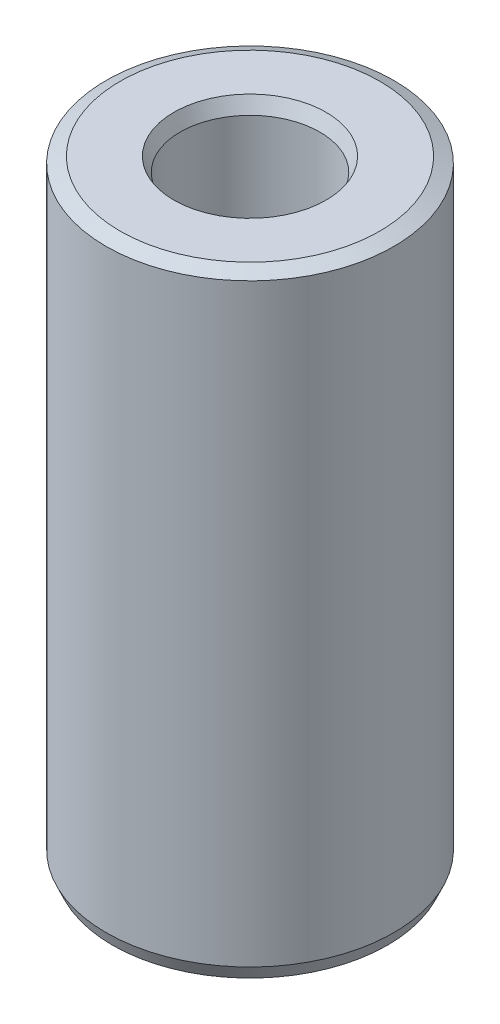
ISO-10303-21;
HEADER;
FILE_DESCRIPTION(('STEP AP214'),'2;1');
FILE_NAME('part.step','',(''),(''),'','','');
FILE_SCHEMA(('AUTOMOTIVE_DESIGN { 1 0 10303 214 1 1 1 1 }'));
ENDSEC;
DATA;
#1=APPLICATION_CONTEXT('core data for automotive mechanical design processes');
#2=APPLICATION_PROTOCOL_DEFINITION('international standard','automotive_design',2000,#1);
#3=PRODUCT_CONTEXT('',#1,'mechanical');
#4=PRODUCT('Part','Part','',(#3));
#5=PRODUCT_RELATED_PRODUCT_CATEGORY('part','',(#4));
#6=PRODUCT_DEFINITION_FORMATION('','',#4);
#7=PRODUCT_DEFINITION_CONTEXT('part definition',#1,'design');
#8=PRODUCT_DEFINITION('design','',#6,#7);
#9=PRODUCT_DEFINITION_SHAPE('','',#8);
#10=(LENGTH_UNIT() NAMED_UNIT(*) SI_UNIT(.MILLI.,.METRE.));
#11=(NAMED_UNIT(*) PLANE_ANGLE_UNIT() SI_UNIT($,.RADIAN.));
#12=(NAMED_UNIT(*) SI_UNIT($,.STERADIAN.) SOLID_ANGLE_UNIT());
#13=UNCERTAINTY_MEASURE_WITH_UNIT(LENGTH_MEASURE(1.E-05),#10,'distance_accuracy_value','');
#14=(GEOMETRIC_REPRESENTATION_CONTEXT(3) GLOBAL_UNCERTAINTY_ASSIGNED_CONTEXT((#13)) GLOBAL_UNIT_ASSIGNED_CONTEXT((#10,
#11,#12)) REPRESENTATION_CONTEXT('',''));
#15=CARTESIAN_POINT('',(0.,0.,0.));
#16=DIRECTION('',(0.,0.,1.));
#17=DIRECTION('',(1.,0.,0.));
#18=AXIS2_PLACEMENT_3D('',#15,#16,#17);
#19=CARTESIAN_POINT('',(0.,138.841651171034,0.));
#20=DIRECTION('',(0.,-1.,0.));
#21=DIRECTION('',(0.,0.,-1.));
#22=AXIS2_PLACEMENT_3D('',#19,#20,#21);
#23=CYLINDRICAL_SURFACE('',#22,32.5);
#24=CARTESIAN_POINT('',(0.,3.16370298457838,0.));
#25=DIRECTION('',(0.,1.,0.));
#26=DIRECTION('',(0.,0.,1.));
#27=AXIS2_PLACEMENT_3D('',#24,#25,#26);
#28=CIRCLE('',#27,32.5);
#29=CARTESIAN_POINT('',(0.,3.16370298457838,32.5));
#30=VERTEX_POINT('',#29);
#31=EDGE_CURVE('E10',#30,#30,#28,.T.);
#32=ORIENTED_EDGE('',*,*,#31,.T.);
#33=EDGE_LOOP('',(#32));
#34=FACE_BOUND('',#33,.T.);
#35=CARTESIAN_POINT('',(0.,137.426130079522,0.));
#36=DIRECTION('',(0.,1.,0.));
#37=DIRECTION('',(0.,0.,1.));
#38=AXIS2_PLACEMENT_3D('',#35,#36,#37);
#39=CIRCLE('',#38,32.5);
#40=CARTESIAN_POINT('',(0.,137.426130079522,32.5));
#41=VERTEX_POINT('',#40);
#42=EDGE_CURVE('E50',#41,#41,#39,.F.);
#43=ORIENTED_EDGE('',*,*,#42,.T.);
#44=EDGE_LOOP('',(#43));
#45=FACE_BOUND('',#44,.T.);
#46=ADVANCED_FACE('F39',(#34,#45),#23,.T.);
#47=CARTESIAN_POINT('',(0.,138.841651171034,0.));
#48=DIRECTION('',(0.,1.,0.));
#49=DIRECTION('',(0.,0.,1.));
#50=AXIS2_PLACEMENT_3D('',#47,#48,#49);
#51=PLANE('',#50);
#52=CARTESIAN_POINT('',(0.,138.841651171034,0.));
#53=DIRECTION('',(0.,1.,0.));
#54=DIRECTION('',(0.,0.,1.));
#55=AXIS2_PLACEMENT_3D('',#52,#53,#54);
#56=CIRCLE('',#55,17.201918085792);
#57=CARTESIAN_POINT('',(0.,138.841651171034,17.201918085792));
#58=VERTEX_POINT('',#57);
#59=EDGE_CURVE('E58',#58,#58,#56,.F.);
#60=ORIENTED_EDGE('',*,*,#59,.T.);
#61=EDGE_LOOP('',(#60));
#62=FACE_BOUND('',#61,.T.);
#63=CARTESIAN_POINT('',(0.,138.841651171034,0.));
#64=DIRECTION('',(0.,1.,0.));
#65=DIRECTION('',(0.,0.,1.));
#66=AXIS2_PLACEMENT_3D('',#63,#64,#65);
#67=CIRCLE('',#66,29.3362970154217);
#68=CARTESIAN_POINT('',(0.,138.841651171034,29.3362970154217));
#69=VERTEX_POINT('',#68);
#70=EDGE_CURVE('E61',#69,#69,#67,.T.);
#71=ORIENTED_EDGE('',*,*,#70,.T.);
#72=EDGE_LOOP('',(#71));
#73=FACE_BOUND('',#72,.T.);
#74=ADVANCED_FACE('F88',(#62,#73),#51,.T.);
#75=CARTESIAN_POINT('',(0.,0.,0.));
#76=DIRECTION('',(0.,1.,0.));
#77=DIRECTION('',(0.,0.,1.));
#78=AXIS2_PLACEMENT_3D('',#75,#76,#77);
#79=PLANE('',#78);
#80=CARTESIAN_POINT('',(0.,0.,0.));
#81=DIRECTION('',(0.,1.,0.));
#82=DIRECTION('',(0.,0.,1.));
#83=AXIS2_PLACEMENT_3D('',#80,#81,#82);
#84=CIRCLE('',#83,18.9500999788592);
#85=CARTESIAN_POINT('',(0.,0.,18.9500999788592));
#86=VERTEX_POINT('',#85);
#87=EDGE_CURVE('E51',#86,#86,#84,.T.);
#88=ORIENTED_EDGE('',*,*,#87,.T.);
#89=EDGE_LOOP('',(#88));
#90=FACE_BOUND('',#89,.T.);
#91=CARTESIAN_POINT('',(0.,0.,0.));
#92=DIRECTION('',(0.,1.,0.));
#93=DIRECTION('',(0.,0.,1.));
#94=AXIS2_PLACEMENT_3D('',#91,#92,#93);
#95=CIRCLE('',#94,31.0844789084888);
#96=CARTESIAN_POINT('',(0.,0.,31.0844789084888));
#97=VERTEX_POINT('',#96);
#98=EDGE_CURVE('E54',#97,#97,#95,.F.);
#99=ORIENTED_EDGE('',*,*,#98,.T.);
#100=EDGE_LOOP('',(#99));
#101=FACE_BOUND('',#100,.T.);
#102=ADVANCED_FACE('F83',(#90,#101),#79,.F.);
#103=CARTESIAN_POINT('',(0.,138.841651171034,0.));
#104=DIRECTION('',(0.,-1.,0.));
#105=DIRECTION('',(0.,0.,-1.));
#106=AXIS2_PLACEMENT_3D('',#103,#104,#105);
#107=CYLINDRICAL_SURFACE('',#106,15.7863969942809);
#108=CARTESIAN_POINT('',(0.,135.677948186455,0.));
#109=DIRECTION('',(0.,1.,0.));
#110=DIRECTION('',(0.,0.,1.));
#111=AXIS2_PLACEMENT_3D('',#108,#109,#110);
#112=CIRCLE('',#111,15.7863969942809);
#113=CARTESIAN_POINT('',(0.,135.677948186455,15.7863969942809));
#114=VERTEX_POINT('',#113);
#115=EDGE_CURVE('E67',#114,#114,#112,.T.);
#116=ORIENTED_EDGE('',*,*,#115,.T.);
#117=EDGE_LOOP('',(#116));
#118=FACE_BOUND('',#117,.T.);
#119=CARTESIAN_POINT('',(0.,1.41552109151116,0.));
#120=DIRECTION('',(0.,1.,0.));
#121=DIRECTION('',(0.,0.,1.));
#122=AXIS2_PLACEMENT_3D('',#119,#120,#121);
#123=CIRCLE('',#122,15.7863969942809);
#124=CARTESIAN_POINT('',(0.,1.41552109151116,15.7863969942809));
#125=VERTEX_POINT('',#124);
#126=EDGE_CURVE('E69',#125,#125,#123,.F.);
#127=ORIENTED_EDGE('',*,*,#126,.T.);
#128=EDGE_LOOP('',(#127));
#129=FACE_BOUND('',#128,.T.);
#130=ADVANCED_FACE('F71',(#118,#129),#107,.F.);
#131=CARTESIAN_POINT('',(0.,135.677948186455,0.));
#132=DIRECTION('',(0.,1.,0.));
#133=DIRECTION('',(0.,0.,1.));
#134=AXIS2_PLACEMENT_3D('',#131,#132,#133);
#135=CONICAL_SURFACE('',#134,15.7863969942809,0.42071082988232);
#136=CARTESIAN_POINT('',(0.,138.841651171034,17.201918085792));
#137=CARTESIAN_POINT('',(0.,138.808695931611,17.1871730744221));
#138=CARTESIAN_POINT('',(0.,138.775740692188,17.1724280630522));
#139=CARTESIAN_POINT('',(0.,138.709830213343,17.1429380403124));
#140=CARTESIAN_POINT('',(0.,138.67687497392,17.1281930289425));
#141=CARTESIAN_POINT('',(0.,138.610964495075,17.0987030062027));
#142=CARTESIAN_POINT('',(0.,138.578009255652,17.0839579948328));
#143=CARTESIAN_POINT('',(0.,138.512098776807,17.054467972093));
#144=CARTESIAN_POINT('',(0.,138.479143537384,17.0397229607231));
#145=CARTESIAN_POINT('',(0.,138.413233058539,17.0102329379832));
#146=CARTESIAN_POINT('',(0.,138.380277819116,16.9954879266133));
#147=CARTESIAN_POINT('',(0.,138.31436734027,16.9659979038735));
#148=CARTESIAN_POINT('',(0.,138.281412100848,16.9512528925036));
#149=CARTESIAN_POINT('',(0.,138.215501622002,16.9217628697638));
#150=CARTESIAN_POINT('',(0.,138.18254638258,16.9070178583939));
#151=CARTESIAN_POINT('',(0.,138.116635903734,16.8775278356541));
#152=CARTESIAN_POINT('',(0.,138.083680664312,16.8627828242842));
#153=CARTESIAN_POINT('',(0.,138.017770185466,16.8332928015443));
#154=CARTESIAN_POINT('',(0.,137.984814946044,16.8185477901744));
#155=CARTESIAN_POINT('',(0.,137.918904467198,16.7890577674346));
#156=CARTESIAN_POINT('',(0.,137.885949227776,16.7743127560647));
#157=CARTESIAN_POINT('',(0.,137.82003874893,16.7448227333249));
#158=CARTESIAN_POINT('',(0.,137.787083509507,16.730077721955));
#159=CARTESIAN_POINT('',(0.,137.721173030662,16.7005876992152));
#160=CARTESIAN_POINT('',(0.,137.688217791239,16.6858426878453));
#161=CARTESIAN_POINT('',(0.,137.622307312394,16.6563526651054));
#162=CARTESIAN_POINT('',(0.,137.589352072971,16.6416076537355));
#163=CARTESIAN_POINT('',(0.,137.523441594126,16.6121176309957));
#164=CARTESIAN_POINT('',(0.,137.490486354703,16.5973726196258));
#165=CARTESIAN_POINT('',(0.,137.424575875858,16.567882596886));
#166=CARTESIAN_POINT('',(0.,137.391620636435,16.5531375855161));
#167=CARTESIAN_POINT('',(0.,137.32571015759,16.5236475627763));
#168=CARTESIAN_POINT('',(0.,137.292754918167,16.5089025514064));
#169=CARTESIAN_POINT('',(0.,137.226844439322,16.4794125286666));
#170=CARTESIAN_POINT('',(0.,137.193889199899,16.4646675172967));
#171=CARTESIAN_POINT('',(0.,137.127978721054,16.4351774945568));
#172=CARTESIAN_POINT('',(0.,137.095023481631,16.4204324831869));
#173=CARTESIAN_POINT('',(0.,137.029113002786,16.3909424604471));
#174=CARTESIAN_POINT('',(0.,136.996157763363,16.3761974490772));
#175=CARTESIAN_POINT('',(0.,136.930247284517,16.3467074263374));
#176=CARTESIAN_POINT('',(0.,136.897292045095,16.3319624149675));
#177=CARTESIAN_POINT('',(0.,136.831381566249,16.3024723922277));
#178=CARTESIAN_POINT('',(0.,136.798426326827,16.2877273808578));
#179=CARTESIAN_POINT('',(0.,136.732515847981,16.2582373581179));
#180=CARTESIAN_POINT('',(0.,136.699560608559,16.243492346748));
#181=CARTESIAN_POINT('',(0.,136.633650129713,16.2140023240082));
#182=CARTESIAN_POINT('',(0.,136.600694890291,16.1992573126383));
#183=CARTESIAN_POINT('',(0.,136.534784411445,16.1697672898985));
#184=CARTESIAN_POINT('',(0.,136.501829172023,16.1550222785286));
#185=CARTESIAN_POINT('',(0.,136.435918693177,16.1255322557888));
#186=CARTESIAN_POINT('',(0.,136.402963453754,16.1107872444189));
#187=CARTESIAN_POINT('',(0.,136.337052974909,16.0812972216791));
#188=CARTESIAN_POINT('',(0.,136.304097735486,16.0665522103091));
#189=CARTESIAN_POINT('',(0.,136.238187256641,16.0370621875693));
#190=CARTESIAN_POINT('',(0.,136.205232017218,16.0223171761994));
#191=CARTESIAN_POINT('',(0.,136.139321538373,15.9928271534596));
#192=CARTESIAN_POINT('',(0.,136.10636629895,15.9780821420897));
#193=CARTESIAN_POINT('',(0.,136.040455820105,15.9485921193499));
#194=CARTESIAN_POINT('',(0.,136.007500580682,15.93384710798));
#195=CARTESIAN_POINT('',(0.,135.941590101837,15.9043570852402));
#196=CARTESIAN_POINT('',(0.,135.908634862414,15.8896120738703));
#197=CARTESIAN_POINT('',(0.,135.842724383569,15.8601220511304));
#198=CARTESIAN_POINT('',(0.,135.809769144146,15.8453770397605));
#199=CARTESIAN_POINT('',(0.,135.743858665301,15.8158870170207));
#200=CARTESIAN_POINT('',(0.,135.710903425878,15.8011420056508));
#201=CARTESIAN_POINT('',(0.,135.677948186455,15.7863969942809));
#202=B_SPLINE_CURVE_WITH_KNOTS('',3,(#136,#137,#138,#139,#140,#141,#142,#143,#144,#145,#146,
#147,#148,#149,#150,#151,#152,#153,#154,#155,#156,#157,#158,#159,#160,#161,#162,#163,#164,#165,
#166,#167,#168,#169,#170,#171,#172,#173,#174,#175,#176,#177,#178,#179,#180,#181,#182,#183,#184,
#185,#186,#187,#188,#189,#190,#191,#192,#193,#194,#195,#196,#197,#198,#199,#200,#201),
.UNSPECIFIED.,.F.,.F.,(4,2,2,2,2,2,2,2,2,2,2,2,2,2,2,2,2,2,2,2,2,2,2,2,2,2,2,2,2,2,2,2,4),(0.,
0.108310518839804,0.216621037679609,0.324931556519439,0.433242075359243,0.541552594199049,
0.649863113038879,0.758173631878683,0.866484150718513,0.974794669558317,1.08310518839812,
1.19141570723795,1.29972622607776,1.40803674491756,1.51634726375739,1.6246577825972,
1.73296830143703,1.84127882027683,1.94958933911664,2.05789985795647,2.16621037679627,
2.27452089563607,2.3828314144759,2.49114193331571,2.59945245215554,2.70776297099534,
2.81607348983515,2.92438400867498,3.03269452751478,3.14100504635459,3.24931556519442,
3.35762608403422,3.46593660287403),.UNSPECIFIED.);
#203=EDGE_CURVE('BSEAM77',#58,#114,#202,.T.);
#204=ORIENTED_EDGE('',*,*,#59,.F.);
#205=ORIENTED_EDGE('',*,*,#115,.F.);
#206=ORIENTED_EDGE('',*,*,#203,.T.);
#207=ORIENTED_EDGE('',*,*,#203,.F.);
#208=EDGE_LOOP('',(#204,#206,#205,#207));
#209=FACE_BOUND('',#208,.T.);
#210=ADVANCED_FACE('F77',(#209),#135,.F.);
#211=CARTESIAN_POINT('',(0.,0.,0.));
#212=DIRECTION('',(0.,-1.,0.));
#213=DIRECTION('',(0.,0.,-1.));
#214=AXIS2_PLACEMENT_3D('',#211,#212,#213);
#215=CONICAL_SURFACE('',#214,18.9500999788592,1.15008549691257);
#216=ORIENTED_EDGE('',*,*,#126,.F.);
#217=EDGE_LOOP('',(#216));
#218=FACE_BOUND('',#217,.T.);
#219=ORIENTED_EDGE('',*,*,#87,.F.);
#220=EDGE_LOOP('',(#219));
#221=FACE_BOUND('',#220,.T.);
#222=ADVANCED_FACE('F73',(#218,#221),#215,.F.);
#223=CARTESIAN_POINT('',(0.,3.16370298457838,0.));
#224=DIRECTION('',(0.,1.,0.));
#225=DIRECTION('',(0.,0.,1.));
#226=AXIS2_PLACEMENT_3D('',#223,#224,#225);
#227=CONICAL_SURFACE('',#226,32.5,0.42071082988232);
#228=CARTESIAN_POINT('',(0.,0.,31.0844789084888));
#229=CARTESIAN_POINT('',(0.,0.0329552394226903,31.0992239198587));
#230=CARTESIAN_POINT('',(0.,0.0659104788453821,31.1139689312286));
#231=CARTESIAN_POINT('',(0.,0.131820957690765,31.1434589539685));
#232=CARTESIAN_POINT('',(0.,0.164776197113457,31.1582039653384));
#233=CARTESIAN_POINT('',(0.,0.23068667595884,31.1876939880782));
#234=CARTESIAN_POINT('',(0.,0.263641915381531,31.2024389994481));
#235=CARTESIAN_POINT('',(0.,0.329552394226914,31.2319290221879));
#236=CARTESIAN_POINT('',(0.,0.362507633649606,31.2466740335578));
#237=CARTESIAN_POINT('',(0.,0.428418112494989,31.2761640562976));
#238=CARTESIAN_POINT('',(0.,0.46137335191768,31.2909090676675));
#239=CARTESIAN_POINT('',(0.,0.527283830763063,31.3203990904073));
#240=CARTESIAN_POINT('',(0.,0.560239070185755,31.3351441017773));
#241=CARTESIAN_POINT('',(0.,0.626149549031138,31.3646341245171));
#242=CARTESIAN_POINT('',(0.,0.659104788453829,31.379379135887));
#243=CARTESIAN_POINT('',(0.,0.725015267299212,31.4088691586268));
#244=CARTESIAN_POINT('',(0.,0.757970506721904,31.4236141699967));
#245=CARTESIAN_POINT('',(0.,0.823880985567286,31.4531041927365));
#246=CARTESIAN_POINT('',(0.,0.856836224989977,31.4678492041064));
#247=CARTESIAN_POINT('',(0.,0.922746703835361,31.4973392268463));
#248=CARTESIAN_POINT('',(0.,0.955701943258053,31.5120842382162));
#249=CARTESIAN_POINT('',(0.,1.02161242210344,31.541574260956));
#250=CARTESIAN_POINT('',(0.,1.05456766152613,31.5563192723259));
#251=CARTESIAN_POINT('',(0.,1.12047814037151,31.5858092950657));
#252=CARTESIAN_POINT('',(0.,1.1534333797942,31.6005543064356));
#253=CARTESIAN_POINT('',(0.,1.21934385863958,31.6300443291754));
#254=CARTESIAN_POINT('',(0.,1.25229909806228,31.6447893405453));
#255=CARTESIAN_POINT('',(0.,1.31820957690766,31.6742793632851));
#256=CARTESIAN_POINT('',(0.,1.35116481633035,31.6890243746551));
#257=CARTESIAN_POINT('',(0.,1.41707529517573,31.7185143973949));
#258=CARTESIAN_POINT('',(0.,1.45003053459842,31.7332594087648));
#259=CARTESIAN_POINT('',(0.,1.51594101344381,31.7627494315046));
#260=CARTESIAN_POINT('',(0.,1.5488962528665,31.7774944428745));
#261=CARTESIAN_POINT('',(0.,1.61480673171188,31.8069844656143));
#262=CARTESIAN_POINT('',(0.,1.64776197113457,31.8217294769842));
#263=CARTESIAN_POINT('',(0.,1.71367244997996,31.851219499724));
#264=CARTESIAN_POINT('',(0.,1.74662768940265,31.8659645110939));
#265=CARTESIAN_POINT('',(0.,1.81253816824803,31.8954545338338));
#266=CARTESIAN_POINT('',(0.,1.84549340767072,31.9101995452037));
#267=CARTESIAN_POINT('',(0.,1.91140388651611,31.9396895679435));
#268=CARTESIAN_POINT('',(0.,1.9443591259388,31.9544345793134));
#269=CARTESIAN_POINT('',(0.,2.01026960478418,31.9839246020532));
#270=CARTESIAN_POINT('',(0.,2.04322484420687,31.9986696134231));
#271=CARTESIAN_POINT('',(0.,2.10913532305225,32.0281596361629));
#272=CARTESIAN_POINT('',(0.,2.14209056247495,32.0429046475329));
#273=CARTESIAN_POINT('',(0.,2.20800104132033,32.0723946702727));
#274=CARTESIAN_POINT('',(0.,2.24095628074302,32.0871396816426));
#275=CARTESIAN_POINT('',(0.,2.3068667595884,32.1166297043824));
#276=CARTESIAN_POINT('',(0.,2.33982199901109,32.1313747157523));
#277=CARTESIAN_POINT('',(0.,2.40573247785648,32.1608647384921));
#278=CARTESIAN_POINT('',(0.,2.43868771727917,32.175609749862));
#279=CARTESIAN_POINT('',(0.,2.50459819612455,32.2050997726018));
#280=CARTESIAN_POINT('',(0.,2.53755343554724,32.2198447839717));
#281=CARTESIAN_POINT('',(0.,2.60346391439263,32.2493348067116));
#282=CARTESIAN_POINT('',(0.,2.63641915381532,32.2640798180815));
#283=CARTESIAN_POINT('',(0.,2.7023296326607,32.2935698408213));
#284=CARTESIAN_POINT('',(0.,2.73528487208339,32.3083148521912));
#285=CARTESIAN_POINT('',(0.,2.80119535092877,32.337804874931));
#286=CARTESIAN_POINT('',(0.,2.83415059035147,32.3525498863009));
#287=CARTESIAN_POINT('',(0.,2.90006106919685,32.3820399090407));
#288=CARTESIAN_POINT('',(0.,2.93301630861954,32.3967849204106));
#289=CARTESIAN_POINT('',(0.,2.99892678746492,32.4262749431505));
#290=CARTESIAN_POINT('',(0.,3.03188202688762,32.4410199545204));
#291=CARTESIAN_POINT('',(0.,3.097792505733,32.4705099772602));
#292=CARTESIAN_POINT('',(0.,3.13074774515569,32.4852549886301));
#293=CARTESIAN_POINT('',(0.,3.16370298457838,32.5));
#294=B_SPLINE_CURVE_WITH_KNOTS('',3,(#228,#229,#230,#231,#232,#233,#234,#235,#236,#237,#238,
#239,#240,#241,#242,#243,#244,#245,#246,#247,#248,#249,#250,#251,#252,#253,#254,#255,#256,#257,
#258,#259,#260,#261,#262,#263,#264,#265,#266,#267,#268,#269,#270,#271,#272,#273,#274,#275,#276,
#277,#278,#279,#280,#281,#282,#283,#284,#285,#286,#287,#288,#289,#290,#291,#292,#293),
.UNSPECIFIED.,.F.,.F.,(4,2,2,2,2,2,2,2,2,2,2,2,2,2,2,2,2,2,2,2,2,2,2,2,2,2,2,2,2,2,2,2,4),(0.,
0.108310518839819,0.216621037679637,0.324931556519456,0.433242075359274,0.541552594199094,
0.649863113038913,0.758173631878732,0.866484150718552,0.974794669558371,1.08310518839819,
1.19141570723801,1.29972622607783,1.40803674491765,1.51634726375746,1.62465778259728,
1.7329683014371,1.84127882027692,1.94958933911674,2.05789985795656,2.16621037679638,
2.2745208956362,2.38283141447602,2.49114193331583,2.59945245215565,2.70776297099547,
2.81607348983529,2.92438400867511,3.03269452751493,3.14100504635474,3.24931556519456,
3.35762608403438,3.4659366028742),.UNSPECIFIED.);
#295=EDGE_CURVE('BSEAM76',#97,#30,#294,.T.);
#296=ORIENTED_EDGE('',*,*,#98,.F.);
#297=ORIENTED_EDGE('',*,*,#31,.F.);
#298=ORIENTED_EDGE('',*,*,#295,.T.);
#299=ORIENTED_EDGE('',*,*,#295,.F.);
#300=EDGE_LOOP('',(#296,#298,#297,#299));
#301=FACE_BOUND('',#300,.T.);
#302=ADVANCED_FACE('F76',(#301),#227,.T.);
#303=CARTESIAN_POINT('',(0.,138.841651171034,0.));
#304=DIRECTION('',(0.,-1.,0.));
#305=DIRECTION('',(0.,0.,-1.));
#306=AXIS2_PLACEMENT_3D('',#303,#304,#305);
#307=CONICAL_SURFACE('',#306,29.3362970154217,1.15008549691257);
#308=ORIENTED_EDGE('',*,*,#42,.F.);
#309=EDGE_LOOP('',(#308));
#310=FACE_BOUND('',#309,.T.);
#311=ORIENTED_EDGE('',*,*,#70,.F.);
#312=EDGE_LOOP('',(#311));
#313=FACE_BOUND('',#312,.T.);
#314=ADVANCED_FACE('F45',(#310,#313),#307,.T.);
#315=CLOSED_SHELL('',(#46,#74,#102,#130,#210,#222,#302,#314));
#316=MANIFOLD_SOLID_BREP('B2',#315);
#317=ADVANCED_BREP_SHAPE_REPRESENTATION('',(#18,#316),#14);
#318=SHAPE_DEFINITION_REPRESENTATION(#9,#317);
ENDSEC;
END-ISO-10303-21;
